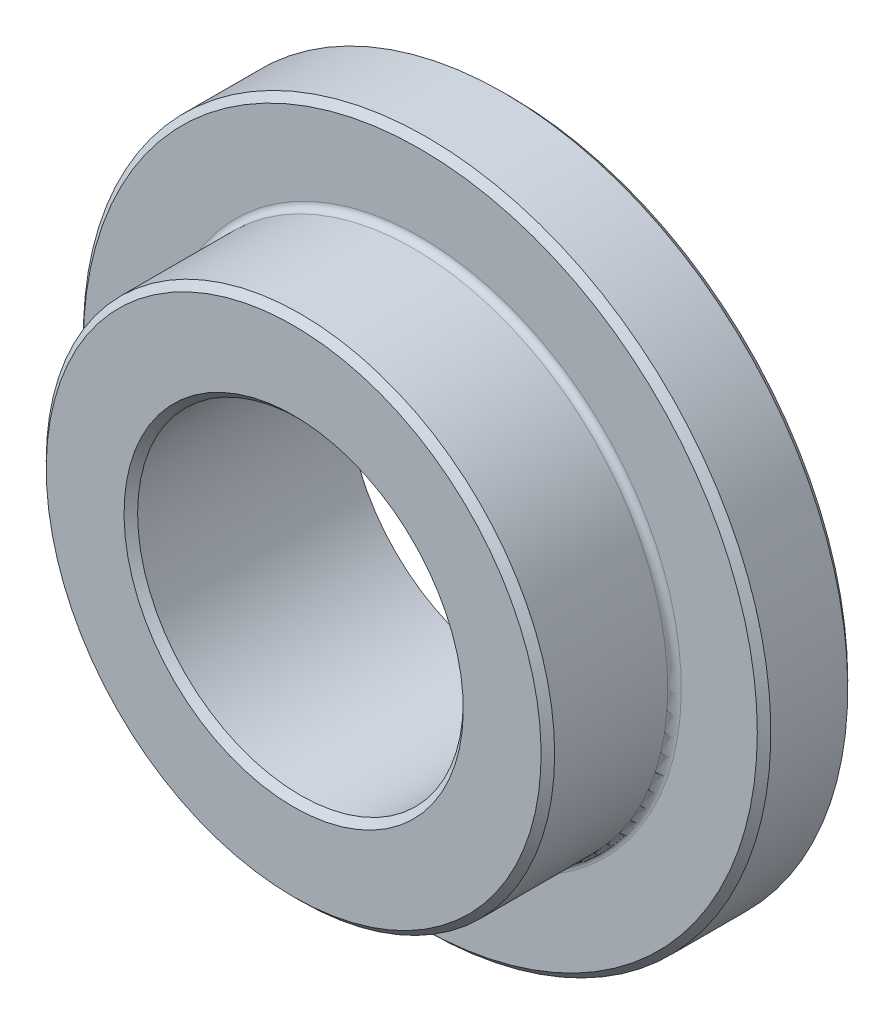
ISO-10303-21;
HEADER;
FILE_DESCRIPTION(('STEP AP214'),'2;1');
FILE_NAME('part.step','',(''),(''),'','','');
FILE_SCHEMA(('AUTOMOTIVE_DESIGN { 1 0 10303 214 1 1 1 1 }'));
ENDSEC;
DATA;
#1=APPLICATION_CONTEXT('core data for automotive mechanical design processes');
#2=APPLICATION_PROTOCOL_DEFINITION('international standard','automotive_design',2000,#1);
#3=PRODUCT_CONTEXT('',#1,'mechanical');
#4=PRODUCT('Part','Part','',(#3));
#5=PRODUCT_RELATED_PRODUCT_CATEGORY('part','',(#4));
#6=PRODUCT_DEFINITION_FORMATION('','',#4);
#7=PRODUCT_DEFINITION_CONTEXT('part definition',#1,'design');
#8=PRODUCT_DEFINITION('design','',#6,#7);
#9=PRODUCT_DEFINITION_SHAPE('','',#8);
#10=(LENGTH_UNIT() NAMED_UNIT(*) SI_UNIT(.MILLI.,.METRE.));
#11=(NAMED_UNIT(*) PLANE_ANGLE_UNIT() SI_UNIT($,.RADIAN.));
#12=(NAMED_UNIT(*) SI_UNIT($,.STERADIAN.) SOLID_ANGLE_UNIT());
#13=UNCERTAINTY_MEASURE_WITH_UNIT(LENGTH_MEASURE(1.E-05),#10,'distance_accuracy_value','');
#14=(GEOMETRIC_REPRESENTATION_CONTEXT(3) GLOBAL_UNCERTAINTY_ASSIGNED_CONTEXT((#13)) GLOBAL_UNIT_ASSIGNED_CONTEXT((#10,
#11,#12)) REPRESENTATION_CONTEXT('',''));
#15=CARTESIAN_POINT('',(0.,0.,0.));
#16=DIRECTION('',(0.,0.,1.));
#17=DIRECTION('',(1.,0.,0.));
#18=AXIS2_PLACEMENT_3D('',#15,#16,#17);
#19=CARTESIAN_POINT('',(0.,9.5,-3.));
#20=DIRECTION('',(0.,0.,-1.));
#21=DIRECTION('',(0.,1.,0.));
#22=AXIS2_PLACEMENT_3D('',#19,#20,#21);
#23=PLANE('',#22);
#24=CARTESIAN_POINT('',(0.,0.,-3.));
#25=DIRECTION('',(0.,0.,-1.));
#26=DIRECTION('',(0.,1.,0.));
#27=AXIS2_PLACEMENT_3D('',#24,#25,#26);
#28=CIRCLE('',#27,9.3125);
#29=CARTESIAN_POINT('',(0.,9.3125,-3.));
#30=VERTEX_POINT('',#29);
#31=EDGE_CURVE('E85',#30,#30,#28,.T.);
#32=ORIENTED_EDGE('',*,*,#31,.T.);
#33=EDGE_LOOP('',(#32));
#34=FACE_BOUND('',#33,.T.);
#35=CARTESIAN_POINT('',(0.,0.,-3.));
#36=DIRECTION('',(0.,0.,-1.));
#37=DIRECTION('',(0.,1.,0.));
#38=AXIS2_PLACEMENT_3D('',#35,#36,#37);
#39=CIRCLE('',#38,4.5);
#40=CARTESIAN_POINT('',(0.,4.5,-3.));
#41=VERTEX_POINT('',#40);
#42=EDGE_CURVE('E89',#41,#41,#39,.T.);
#43=ORIENTED_EDGE('',*,*,#42,.F.);
#44=EDGE_LOOP('',(#43));
#45=FACE_BOUND('',#44,.T.);
#46=ADVANCED_FACE('F41',(#34,#45),#23,.T.);
#47=CARTESIAN_POINT('',(0.,0.,-3.));
#48=DIRECTION('',(0.,0.,-1.));
#49=DIRECTION('',(0.,1.,0.));
#50=AXIS2_PLACEMENT_3D('',#47,#48,#49);
#51=CYLINDRICAL_SURFACE('',#50,9.5);
#52=CARTESIAN_POINT('',(0.,0.,-2.8125));
#53=DIRECTION('',(0.,0.,-1.));
#54=DIRECTION('',(0.,1.,0.));
#55=AXIS2_PLACEMENT_3D('',#52,#53,#54);
#56=CIRCLE('',#55,9.5);
#57=CARTESIAN_POINT('',(0.,9.5,-2.8125));
#58=VERTEX_POINT('',#57);
#59=EDGE_CURVE('E77',#58,#58,#56,.F.);
#60=ORIENTED_EDGE('',*,*,#59,.T.);
#61=EDGE_LOOP('',(#60));
#62=FACE_BOUND('',#61,.T.);
#63=CARTESIAN_POINT('',(0.,0.,-0.687499999999996));
#64=DIRECTION('',(0.,0.,1.));
#65=DIRECTION('',(0.,-1.,0.));
#66=AXIS2_PLACEMENT_3D('',#63,#64,#65);
#67=CIRCLE('',#66,9.5);
#68=CARTESIAN_POINT('',(0.,-9.5,-0.687499999999997));
#69=VERTEX_POINT('',#68);
#70=EDGE_CURVE('E81',#69,#69,#67,.F.);
#71=ORIENTED_EDGE('',*,*,#70,.T.);
#72=EDGE_LOOP('',(#71));
#73=FACE_BOUND('',#72,.T.);
#74=ADVANCED_FACE('F97',(#62,#73),#51,.T.);
#75=CARTESIAN_POINT('',(0.,9.5,-0.499999999999999));
#76=DIRECTION('',(0.,0.,1.));
#77=DIRECTION('',(0.,-1.,0.));
#78=AXIS2_PLACEMENT_3D('',#75,#76,#77);
#79=PLANE('',#78);
#80=CARTESIAN_POINT('',(0.,0.,-0.500000000000001));
#81=DIRECTION('',(0.,0.,1.));
#82=DIRECTION('',(0.,-1.,0.));
#83=AXIS2_PLACEMENT_3D('',#80,#81,#82);
#84=CIRCLE('',#83,7.2125);
#85=CARTESIAN_POINT('',(0.,-7.2125,-0.500000000000002));
#86=VERTEX_POINT('',#85);
#87=EDGE_CURVE('E49',#86,#86,#84,.F.);
#88=ORIENTED_EDGE('',*,*,#87,.T.);
#89=EDGE_LOOP('',(#88));
#90=FACE_BOUND('',#89,.T.);
#91=CARTESIAN_POINT('',(0.,0.,-0.500000000000001));
#92=DIRECTION('',(0.,0.,1.));
#93=DIRECTION('',(0.,-1.,0.));
#94=AXIS2_PLACEMENT_3D('',#91,#92,#93);
#95=CIRCLE('',#94,9.31250000000001);
#96=CARTESIAN_POINT('',(0.,-9.31250000000001,-0.500000000000002));
#97=VERTEX_POINT('',#96);
#98=EDGE_CURVE('E73',#97,#97,#95,.T.);
#99=ORIENTED_EDGE('',*,*,#98,.T.);
#100=EDGE_LOOP('',(#99));
#101=FACE_BOUND('',#100,.T.);
#102=ADVANCED_FACE('F103',(#90,#101),#79,.T.);
#103=CARTESIAN_POINT('',(0.,0.,-3.));
#104=DIRECTION('',(0.,0.,-1.));
#105=DIRECTION('',(0.,1.,0.));
#106=AXIS2_PLACEMENT_3D('',#103,#104,#105);
#107=CYLINDRICAL_SURFACE('',#106,7.025);
#108=CARTESIAN_POINT('',(0.,0.,-0.312500000000001));
#109=DIRECTION('',(0.,0.,1.));
#110=DIRECTION('',(0.,-1.,0.));
#111=AXIS2_PLACEMENT_3D('',#108,#109,#110);
#112=CIRCLE('',#111,7.025);
#113=CARTESIAN_POINT('',(0.,-7.025,-0.312500000000002));
#114=VERTEX_POINT('',#113);
#115=EDGE_CURVE('E10',#114,#114,#112,.T.);
#116=ORIENTED_EDGE('',*,*,#115,.T.);
#117=EDGE_LOOP('',(#116));
#118=FACE_BOUND('',#117,.T.);
#119=CARTESIAN_POINT('',(0.,0.,2.8125));
#120=DIRECTION('',(0.,0.,1.));
#121=DIRECTION('',(0.,-1.,0.));
#122=AXIS2_PLACEMENT_3D('',#119,#120,#121);
#123=CIRCLE('',#122,7.025);
#124=CARTESIAN_POINT('',(0.,-7.025,2.8125));
#125=VERTEX_POINT('',#124);
#126=EDGE_CURVE('E69',#125,#125,#123,.F.);
#127=ORIENTED_EDGE('',*,*,#126,.T.);
#128=EDGE_LOOP('',(#127));
#129=FACE_BOUND('',#128,.T.);
#130=ADVANCED_FACE('F133',(#118,#129),#107,.T.);
#131=CARTESIAN_POINT('',(0.,7.025,3.));
#132=DIRECTION('',(0.,0.,1.));
#133=DIRECTION('',(0.,-1.,0.));
#134=AXIS2_PLACEMENT_3D('',#131,#132,#133);
#135=PLANE('',#134);
#136=CARTESIAN_POINT('',(0.,0.,3.));
#137=DIRECTION('',(0.,0.,1.));
#138=DIRECTION('',(0.,-1.,0.));
#139=AXIS2_PLACEMENT_3D('',#136,#137,#138);
#140=CIRCLE('',#139,6.8375);
#141=CARTESIAN_POINT('',(0.,-6.8375,3.));
#142=VERTEX_POINT('',#141);
#143=EDGE_CURVE('E59',#142,#142,#140,.T.);
#144=ORIENTED_EDGE('',*,*,#143,.T.);
#145=EDGE_LOOP('',(#144));
#146=FACE_BOUND('',#145,.T.);
#147=CARTESIAN_POINT('',(0.,0.,3.));
#148=DIRECTION('',(0.,0.,1.));
#149=DIRECTION('',(0.,-1.,0.));
#150=AXIS2_PLACEMENT_3D('',#147,#148,#149);
#151=CIRCLE('',#150,4.6875);
#152=CARTESIAN_POINT('',(0.,-4.6875,3.));
#153=VERTEX_POINT('',#152);
#154=EDGE_CURVE('E65',#153,#153,#151,.F.);
#155=ORIENTED_EDGE('',*,*,#154,.T.);
#156=EDGE_LOOP('',(#155));
#157=FACE_BOUND('',#156,.T.);
#158=ADVANCED_FACE('F131',(#146,#157),#135,.T.);
#159=CARTESIAN_POINT('',(0.,0.,-3.));
#160=DIRECTION('',(0.,0.,-1.));
#161=DIRECTION('',(0.,1.,0.));
#162=AXIS2_PLACEMENT_3D('',#159,#160,#161);
#163=CYLINDRICAL_SURFACE('',#162,4.5);
#164=CARTESIAN_POINT('',(0.,0.,2.8125));
#165=DIRECTION('',(0.,0.,1.));
#166=DIRECTION('',(0.,-1.,0.));
#167=AXIS2_PLACEMENT_3D('',#164,#165,#166);
#168=CIRCLE('',#167,4.5);
#169=CARTESIAN_POINT('',(0.,-4.5,2.8125));
#170=VERTEX_POINT('',#169);
#171=EDGE_CURVE('E54',#170,#170,#168,.T.);
#172=ORIENTED_EDGE('',*,*,#171,.T.);
#173=EDGE_LOOP('',(#172));
#174=FACE_BOUND('',#173,.T.);
#175=ORIENTED_EDGE('',*,*,#42,.T.);
#176=EDGE_LOOP('',(#175));
#177=FACE_BOUND('',#176,.T.);
#178=ADVANCED_FACE('F94',(#174,#177),#163,.F.);
#179=CARTESIAN_POINT('',(0.,0.,-3.));
#180=DIRECTION('',(0.,0.,1.));
#181=DIRECTION('',(0.,-1.,0.));
#182=AXIS2_PLACEMENT_3D('',#179,#180,#181);
#183=CONICAL_SURFACE('',#182,9.3125,0.785398163397453);
#184=ORIENTED_EDGE('',*,*,#59,.F.);
#185=EDGE_LOOP('',(#184));
#186=FACE_BOUND('',#185,.T.);
#187=ORIENTED_EDGE('',*,*,#31,.F.);
#188=EDGE_LOOP('',(#187));
#189=FACE_BOUND('',#188,.T.);
#190=ADVANCED_FACE('F108',(#186,#189),#183,.T.);
#191=CARTESIAN_POINT('',(0.,0.,-0.687499999999996));
#192=DIRECTION('',(0.,0.,-1.));
#193=DIRECTION('',(0.,1.,0.));
#194=AXIS2_PLACEMENT_3D('',#191,#192,#193);
#195=CONICAL_SURFACE('',#194,9.5,0.785398163397448);
#196=ORIENTED_EDGE('',*,*,#98,.F.);
#197=EDGE_LOOP('',(#196));
#198=FACE_BOUND('',#197,.T.);
#199=ORIENTED_EDGE('',*,*,#70,.F.);
#200=EDGE_LOOP('',(#199));
#201=FACE_BOUND('',#200,.T.);
#202=ADVANCED_FACE('F111',(#198,#201),#195,.T.);
#203=CARTESIAN_POINT('',(0.,0.,2.8125));
#204=DIRECTION('',(0.,0.,-1.));
#205=DIRECTION('',(0.,1.,0.));
#206=AXIS2_PLACEMENT_3D('',#203,#204,#205);
#207=CONICAL_SURFACE('',#206,7.025,0.785398163397453);
#208=ORIENTED_EDGE('',*,*,#143,.F.);
#209=EDGE_LOOP('',(#208));
#210=FACE_BOUND('',#209,.T.);
#211=ORIENTED_EDGE('',*,*,#126,.F.);
#212=EDGE_LOOP('',(#211));
#213=FACE_BOUND('',#212,.T.);
#214=ADVANCED_FACE('F115',(#210,#213),#207,.T.);
#215=CARTESIAN_POINT('',(0.,0.,3.));
#216=DIRECTION('',(0.,0.,1.));
#217=DIRECTION('',(0.,-1.,0.));
#218=AXIS2_PLACEMENT_3D('',#215,#216,#217);
#219=CONICAL_SURFACE('',#218,4.6875,0.785398163397451);
#220=ORIENTED_EDGE('',*,*,#171,.F.);
#221=EDGE_LOOP('',(#220));
#222=FACE_BOUND('',#221,.T.);
#223=ORIENTED_EDGE('',*,*,#154,.F.);
#224=EDGE_LOOP('',(#223));
#225=FACE_BOUND('',#224,.T.);
#226=ADVANCED_FACE('F118',(#222,#225),#219,.F.);
#227=CARTESIAN_POINT('',(0.,0.,-0.312500000000001));
#228=DIRECTION('',(0.,0.,1.));
#229=DIRECTION('',(0.,-1.,0.));
#230=AXIS2_PLACEMENT_3D('',#227,#228,#229);
#231=TOROIDAL_SURFACE('',#230,7.2125,0.1875);
#232=ORIENTED_EDGE('',*,*,#115,.F.);
#233=EDGE_LOOP('',(#232));
#234=FACE_BOUND('',#233,.T.);
#235=ORIENTED_EDGE('',*,*,#87,.F.);
#236=EDGE_LOOP('',(#235));
#237=FACE_BOUND('',#236,.T.);
#238=ADVANCED_FACE('F43',(#234,#237),#231,.F.);
#239=CLOSED_SHELL('',(#46,#74,#102,#130,#158,#178,#190,#202,#214,#226,#238));
#240=MANIFOLD_SOLID_BREP('B2',#239);
#241=ADVANCED_BREP_SHAPE_REPRESENTATION('',(#18,#240),#14);
#242=SHAPE_DEFINITION_REPRESENTATION(#9,#241);
ENDSEC;
END-ISO-10303-21;
